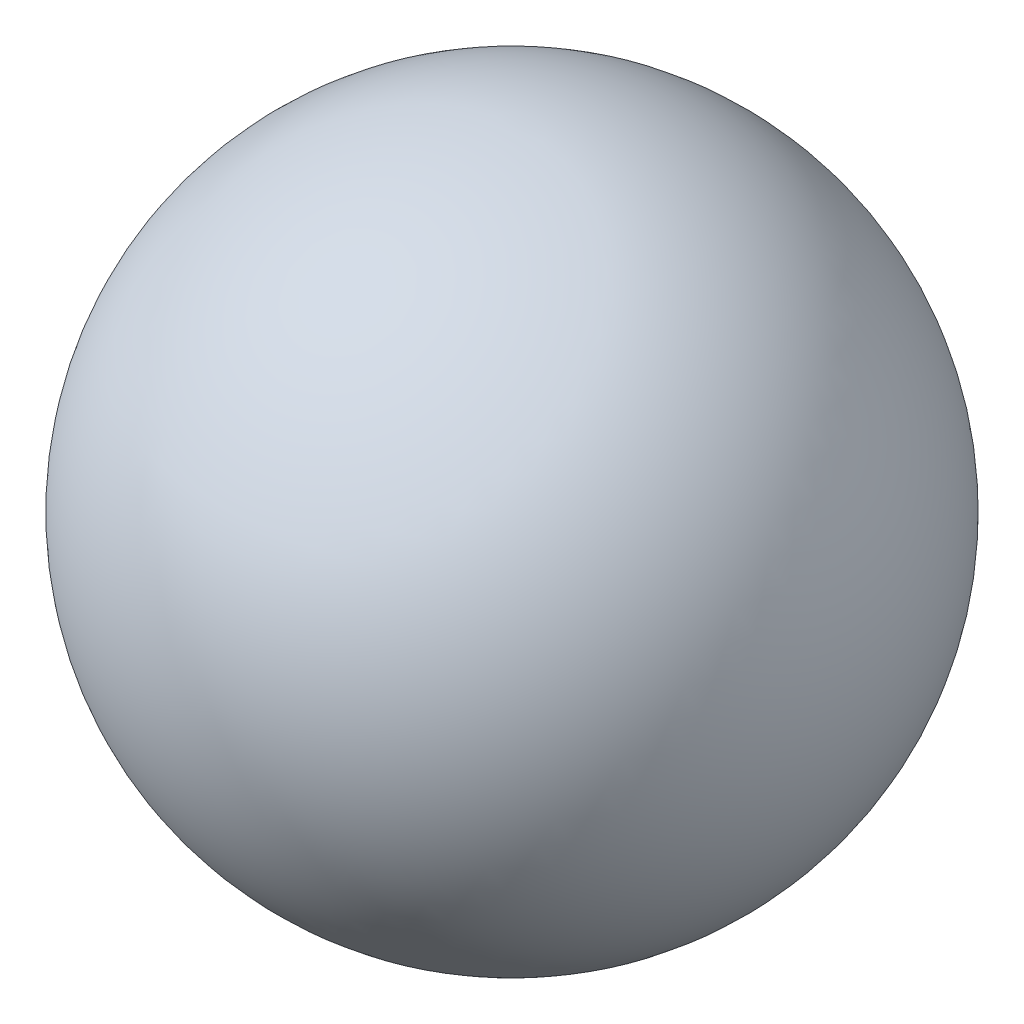
ISO-10303-21;
HEADER;
FILE_DESCRIPTION(('STEP AP214'),'2;1');
FILE_NAME('part.step','',(''),(''),'','','');
FILE_SCHEMA(('AUTOMOTIVE_DESIGN { 1 0 10303 214 1 1 1 1 }'));
ENDSEC;
DATA;
#1=APPLICATION_CONTEXT('core data for automotive mechanical design processes');
#2=APPLICATION_PROTOCOL_DEFINITION('international standard','automotive_design',2000,#1);
#3=PRODUCT_CONTEXT('',#1,'mechanical');
#4=PRODUCT('Part','Part','',(#3));
#5=PRODUCT_RELATED_PRODUCT_CATEGORY('part','',(#4));
#6=PRODUCT_DEFINITION_FORMATION('','',#4);
#7=PRODUCT_DEFINITION_CONTEXT('part definition',#1,'design');
#8=PRODUCT_DEFINITION('design','',#6,#7);
#9=PRODUCT_DEFINITION_SHAPE('','',#8);
#10=(LENGTH_UNIT() NAMED_UNIT(*) SI_UNIT(.MILLI.,.METRE.));
#11=(NAMED_UNIT(*) PLANE_ANGLE_UNIT() SI_UNIT($,.RADIAN.));
#12=(NAMED_UNIT(*) SI_UNIT($,.STERADIAN.) SOLID_ANGLE_UNIT());
#13=UNCERTAINTY_MEASURE_WITH_UNIT(LENGTH_MEASURE(1.E-05),#10,'distance_accuracy_value','');
#14=(GEOMETRIC_REPRESENTATION_CONTEXT(3) GLOBAL_UNCERTAINTY_ASSIGNED_CONTEXT((#13)) GLOBAL_UNIT_ASSIGNED_CONTEXT((#10,
#11,#12)) REPRESENTATION_CONTEXT('',''));
#15=CARTESIAN_POINT('',(0.,0.,0.));
#16=DIRECTION('',(0.,0.,1.));
#17=DIRECTION('',(1.,0.,0.));
#18=AXIS2_PLACEMENT_3D('',#15,#16,#17);
#19=CARTESIAN_POINT('',(0.,0.,0.));
#20=DIRECTION('',(0.,-1.,0.));
#21=DIRECTION('',(-1.,0.,0.));
#22=AXIS2_PLACEMENT_3D('',#19,#20,#21);
#23=SPHERICAL_SURFACE('',#22,65.);
#24=CARTESIAN_POINT('',(0.,-65.,0.));
#25=VERTEX_POINT('',#24);
#26=VERTEX_LOOP('',#25);
#27=FACE_BOUND('',#26,.T.);
#28=ADVANCED_FACE('F33',(#27),#23,.T.);
#29=CLOSED_SHELL('',(#28));
#30=MANIFOLD_SOLID_BREP('B2',#29);
#31=ADVANCED_BREP_SHAPE_REPRESENTATION('',(#18,#30),#14);
#32=SHAPE_DEFINITION_REPRESENTATION(#9,#31);
ENDSEC;
END-ISO-10303-21;
